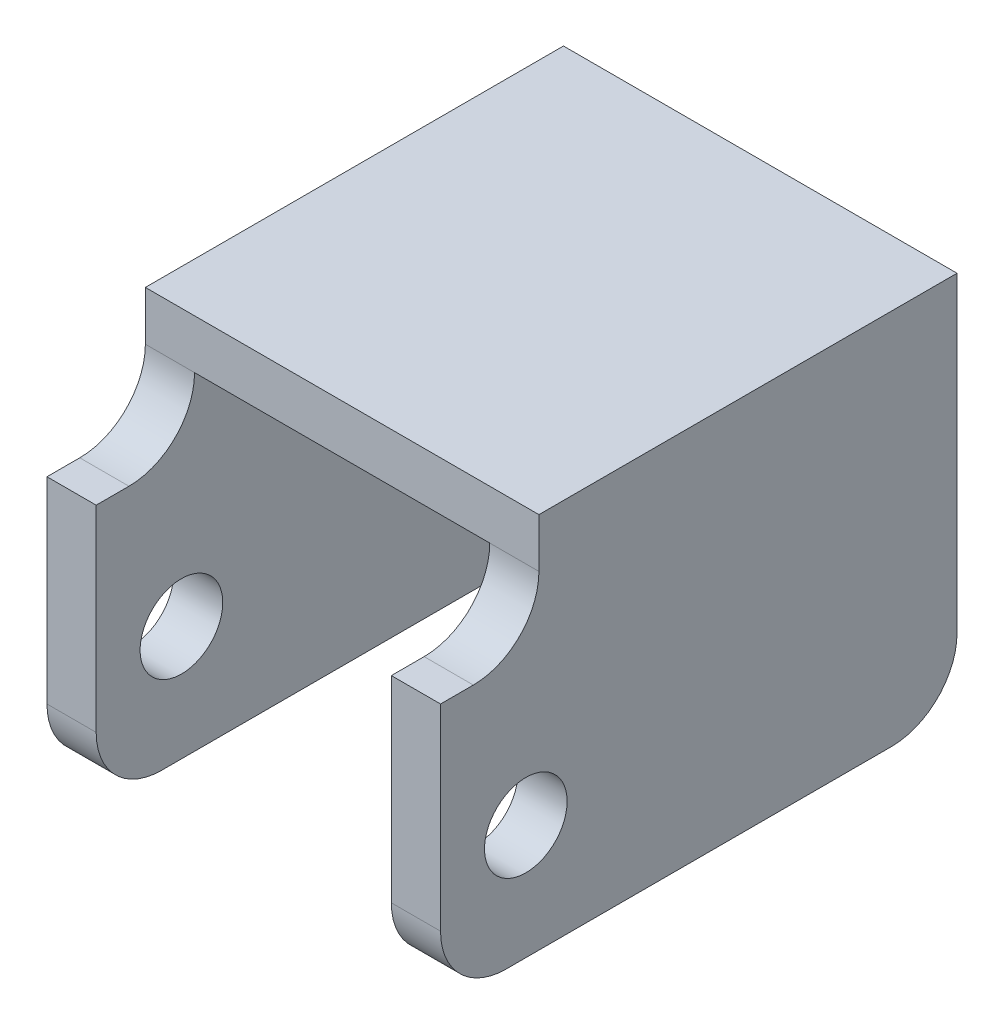
ISO-10303-21;
HEADER;
FILE_DESCRIPTION(('STEP AP214'),'2;1');
FILE_NAME('part.step','',(''),(''),'','','');
FILE_SCHEMA(('AUTOMOTIVE_DESIGN { 1 0 10303 214 1 1 1 1 }'));
ENDSEC;
DATA;
#1=APPLICATION_CONTEXT('core data for automotive mechanical design processes');
#2=APPLICATION_PROTOCOL_DEFINITION('international standard','automotive_design',2000,#1);
#3=PRODUCT_CONTEXT('',#1,'mechanical');
#4=PRODUCT('Part','Part','',(#3));
#5=PRODUCT_RELATED_PRODUCT_CATEGORY('part','',(#4));
#6=PRODUCT_DEFINITION_FORMATION('','',#4);
#7=PRODUCT_DEFINITION_CONTEXT('part definition',#1,'design');
#8=PRODUCT_DEFINITION('design','',#6,#7);
#9=PRODUCT_DEFINITION_SHAPE('','',#8);
#10=(LENGTH_UNIT() NAMED_UNIT(*) SI_UNIT(.MILLI.,.METRE.));
#11=(NAMED_UNIT(*) PLANE_ANGLE_UNIT() SI_UNIT($,.RADIAN.));
#12=(NAMED_UNIT(*) SI_UNIT($,.STERADIAN.) SOLID_ANGLE_UNIT());
#13=UNCERTAINTY_MEASURE_WITH_UNIT(LENGTH_MEASURE(1.E-05),#10,'distance_accuracy_value','');
#14=(GEOMETRIC_REPRESENTATION_CONTEXT(3) GLOBAL_UNCERTAINTY_ASSIGNED_CONTEXT((#13)) GLOBAL_UNIT_ASSIGNED_CONTEXT((#10,
#11,#12)) REPRESENTATION_CONTEXT('',''));
#15=CARTESIAN_POINT('',(0.,0.,0.));
#16=DIRECTION('',(0.,0.,1.));
#17=DIRECTION('',(1.,0.,0.));
#18=AXIS2_PLACEMENT_3D('',#15,#16,#17);
#19=CARTESIAN_POINT('',(-19.05,4.7625,0.));
#20=DIRECTION('',(1.,0.,0.));
#21=DIRECTION('',(0.,0.,-1.));
#22=AXIS2_PLACEMENT_3D('',#19,#20,#21);
#23=PLANE('',#22);
#24=CARTESIAN_POINT('',(-19.05,-20.6375,16.745));
#25=DIRECTION('',(1.,0.,0.));
#26=DIRECTION('',(0.,0.,-1.));
#27=AXIS2_PLACEMENT_3D('',#24,#25,#26);
#28=CIRCLE('',#27,4.);
#29=CARTESIAN_POINT('',(-19.05,-20.6375,12.745));
#30=VERTEX_POINT('',#29);
#31=EDGE_CURVE('E328',#30,#30,#28,.T.);
#32=ORIENTED_EDGE('',*,*,#31,.T.);
#33=EDGE_LOOP('',(#32));
#34=FACE_BOUND('',#33,.T.);
#35=DIRECTION('',(0.,-1.,0.));
#36=VECTOR('',#35,1.);
#37=CARTESIAN_POINT('',(-19.05,4.7625,-25.));
#38=LINE('',#37,#36);
#39=CARTESIAN_POINT('',(-19.05,4.7625,-25.));
#40=VERTEX_POINT('',#39);
#41=CARTESIAN_POINT('',(-19.05,-25.4,-25.));
#42=VERTEX_POINT('',#41);
#43=EDGE_CURVE('E206',#40,#42,#38,.T.);
#44=ORIENTED_EDGE('',*,*,#43,.T.);
#45=CARTESIAN_POINT('',(-19.05,-25.4,-18.65));
#46=DIRECTION('',(1.,0.,0.));
#47=DIRECTION('',(0.,0.,-1.));
#48=AXIS2_PLACEMENT_3D('',#45,#46,#47);
#49=CIRCLE('',#48,6.35);
#50=CARTESIAN_POINT('',(-19.05,-31.75,-18.65));
#51=VERTEX_POINT('',#50);
#52=EDGE_CURVE('E222',#42,#51,#49,.F.);
#53=ORIENTED_EDGE('',*,*,#52,.T.);
#54=DIRECTION('',(0.,0.,1.));
#55=VECTOR('',#54,1.);
#56=CARTESIAN_POINT('',(-19.05,-31.75,0.));
#57=LINE('',#56,#55);
#58=CARTESIAN_POINT('',(-19.05,-31.75,18.65));
#59=VERTEX_POINT('',#58);
#60=EDGE_CURVE('E301',#51,#59,#57,.T.);
#61=ORIENTED_EDGE('',*,*,#60,.T.);
#62=CARTESIAN_POINT('',(-19.05,-25.4,18.65));
#63=DIRECTION('',(1.,0.,0.));
#64=DIRECTION('',(0.,0.,-1.));
#65=AXIS2_PLACEMENT_3D('',#62,#63,#64);
#66=CIRCLE('',#65,6.35);
#67=CARTESIAN_POINT('',(-19.05,-25.4,25.));
#68=VERTEX_POINT('',#67);
#69=EDGE_CURVE('E220',#59,#68,#66,.F.);
#70=ORIENTED_EDGE('',*,*,#69,.T.);
#71=DIRECTION('',(0.,-1.,0.));
#72=VECTOR('',#71,1.);
#73=CARTESIAN_POINT('',(-19.05,4.7625,25.));
#74=LINE('',#73,#72);
#75=CARTESIAN_POINT('',(-19.05,-6.35,25.));
#76=VERTEX_POINT('',#75);
#77=EDGE_CURVE('E203',#76,#68,#74,.T.);
#78=ORIENTED_EDGE('',*,*,#77,.F.);
#79=DIRECTION('',(0.,0.,1.));
#80=VECTOR('',#79,1.);
#81=CARTESIAN_POINT('',(-19.05,-6.35,0.));
#82=LINE('',#81,#80);
#83=CARTESIAN_POINT('',(-19.05,-6.35,21.825));
#84=VERTEX_POINT('',#83);
#85=EDGE_CURVE('E171',#84,#76,#82,.T.);
#86=ORIENTED_EDGE('',*,*,#85,.F.);
#87=CARTESIAN_POINT('',(-19.05,0.,21.825));
#88=DIRECTION('',(1.,0.,0.));
#89=DIRECTION('',(0.,0.,-1.));
#90=AXIS2_PLACEMENT_3D('',#87,#88,#89);
#91=CIRCLE('',#90,6.35);
#92=CARTESIAN_POINT('',(-19.05,0.,15.475));
#93=VERTEX_POINT('',#92);
#94=EDGE_CURVE('E166',#84,#93,#91,.T.);
#95=ORIENTED_EDGE('',*,*,#94,.T.);
#96=DIRECTION('',(0.,1.,0.));
#97=VECTOR('',#96,1.);
#98=CARTESIAN_POINT('',(-19.05,0.,15.475));
#99=LINE('',#98,#97);
#100=CARTESIAN_POINT('',(-19.05,4.7625,15.475));
#101=VERTEX_POINT('',#100);
#102=EDGE_CURVE('E158',#93,#101,#99,.T.);
#103=ORIENTED_EDGE('',*,*,#102,.T.);
#104=DIRECTION('',(0.,0.,1.));
#105=VECTOR('',#104,1.);
#106=CARTESIAN_POINT('',(-19.05,4.7625,0.));
#107=LINE('',#106,#105);
#108=EDGE_CURVE('E162',#40,#101,#107,.T.);
#109=ORIENTED_EDGE('',*,*,#108,.F.);
#110=EDGE_LOOP('',(#44,#53,#61,#70,#78,#86,#95,#103,#109));
#111=FACE_BOUND('',#110,.T.);
#112=ADVANCED_FACE('F38',(#34,#111),#23,.F.);
#113=CARTESIAN_POINT('',(0.,4.7625,25.));
#114=DIRECTION('',(0.,0.,1.));
#115=DIRECTION('',(1.,0.,0.));
#116=AXIS2_PLACEMENT_3D('',#113,#114,#115);
#117=PLANE('',#116);
#118=DIRECTION('',(0.,1.,0.));
#119=VECTOR('',#118,1.);
#120=CARTESIAN_POINT('',(14.2875,-31.75,25.));
#121=LINE('',#120,#119);
#122=CARTESIAN_POINT('',(14.2875,-25.4,25.));
#123=VERTEX_POINT('',#122);
#124=CARTESIAN_POINT('',(14.2875,-6.35,25.));
#125=VERTEX_POINT('',#124);
#126=EDGE_CURVE('E296',#123,#125,#121,.T.);
#127=ORIENTED_EDGE('',*,*,#126,.F.);
#128=DIRECTION('',(1.,0.,0.));
#129=VECTOR('',#128,1.);
#130=CARTESIAN_POINT('',(19.05,-25.4,25.));
#131=LINE('',#130,#129);
#132=CARTESIAN_POINT('',(19.05,-25.4,25.));
#133=VERTEX_POINT('',#132);
#134=EDGE_CURVE('E247',#123,#133,#131,.T.);
#135=ORIENTED_EDGE('',*,*,#134,.T.);
#136=DIRECTION('',(0.,-1.,0.));
#137=VECTOR('',#136,1.);
#138=CARTESIAN_POINT('',(19.05,4.7625,25.));
#139=LINE('',#138,#137);
#140=CARTESIAN_POINT('',(19.05,-6.35,25.));
#141=VERTEX_POINT('',#140);
#142=EDGE_CURVE('E200',#141,#133,#139,.T.);
#143=ORIENTED_EDGE('',*,*,#142,.F.);
#144=DIRECTION('',(1.,0.,0.));
#145=VECTOR('',#144,1.);
#146=CARTESIAN_POINT('',(-19.05,-6.35,25.));
#147=LINE('',#146,#145);
#148=EDGE_CURVE('E181',#125,#141,#147,.T.);
#149=ORIENTED_EDGE('',*,*,#148,.F.);
#150=EDGE_LOOP('',(#127,#135,#143,#149));
#151=FACE_BOUND('',#150,.T.);
#152=ADVANCED_FACE('F350',(#151),#117,.T.);
#153=ORIENTED_EDGE('',*,*,#77,.T.);
#154=DIRECTION('',(-1.,0.,0.));
#155=VECTOR('',#154,1.);
#156=CARTESIAN_POINT('',(-14.2875,-25.4,25.));
#157=LINE('',#156,#155);
#158=CARTESIAN_POINT('',(-14.2875,-25.4,25.));
#159=VERTEX_POINT('',#158);
#160=EDGE_CURVE('E245',#68,#159,#157,.F.);
#161=ORIENTED_EDGE('',*,*,#160,.T.);
#162=DIRECTION('',(0.,1.,0.));
#163=VECTOR('',#162,1.);
#164=CARTESIAN_POINT('',(-14.2875,-31.75,25.));
#165=LINE('',#164,#163);
#166=CARTESIAN_POINT('',(-14.2875,-6.35,25.));
#167=VERTEX_POINT('',#166);
#168=EDGE_CURVE('E307',#159,#167,#165,.T.);
#169=ORIENTED_EDGE('',*,*,#168,.T.);
#170=EDGE_CURVE('E213',#76,#167,#147,.T.);
#171=ORIENTED_EDGE('',*,*,#170,.F.);
#172=EDGE_LOOP('',(#153,#161,#169,#171));
#173=FACE_BOUND('',#172,.T.);
#174=ADVANCED_FACE('F312',(#173),#117,.T.);
#175=CARTESIAN_POINT('',(19.05,4.7625,0.));
#176=DIRECTION('',(1.,0.,0.));
#177=DIRECTION('',(0.,0.,-1.));
#178=AXIS2_PLACEMENT_3D('',#175,#176,#177);
#179=PLANE('',#178);
#180=CARTESIAN_POINT('',(19.05,-20.6375,16.745));
#181=DIRECTION('',(1.,0.,0.));
#182=DIRECTION('',(0.,0.,-1.));
#183=AXIS2_PLACEMENT_3D('',#180,#181,#182);
#184=CIRCLE('',#183,4.);
#185=CARTESIAN_POINT('',(19.05,-20.6375,12.745));
#186=VERTEX_POINT('',#185);
#187=EDGE_CURVE('E269',#186,#186,#184,.T.);
#188=ORIENTED_EDGE('',*,*,#187,.F.);
#189=EDGE_LOOP('',(#188));
#190=FACE_BOUND('',#189,.T.);
#191=DIRECTION('',(0.,0.,1.));
#192=VECTOR('',#191,1.);
#193=CARTESIAN_POINT('',(19.05,-31.75,0.));
#194=LINE('',#193,#192);
#195=CARTESIAN_POINT('',(19.05,-31.75,-18.65));
#196=VERTEX_POINT('',#195);
#197=CARTESIAN_POINT('',(19.05,-31.75,18.65));
#198=VERTEX_POINT('',#197);
#199=EDGE_CURVE('E287',#196,#198,#194,.T.);
#200=ORIENTED_EDGE('',*,*,#199,.F.);
#201=CARTESIAN_POINT('',(19.05,-25.4,-18.65));
#202=DIRECTION('',(1.,0.,0.));
#203=DIRECTION('',(0.,0.,-1.));
#204=AXIS2_PLACEMENT_3D('',#201,#202,#203);
#205=CIRCLE('',#204,6.35);
#206=CARTESIAN_POINT('',(19.05,-25.4,-25.));
#207=VERTEX_POINT('',#206);
#208=EDGE_CURVE('E240',#196,#207,#205,.T.);
#209=ORIENTED_EDGE('',*,*,#208,.T.);
#210=DIRECTION('',(0.,-1.,0.));
#211=VECTOR('',#210,1.);
#212=CARTESIAN_POINT('',(19.05,4.7625,-25.));
#213=LINE('',#212,#211);
#214=CARTESIAN_POINT('',(19.05,4.7625,-25.));
#215=VERTEX_POINT('',#214);
#216=EDGE_CURVE('E189',#215,#207,#213,.T.);
#217=ORIENTED_EDGE('',*,*,#216,.F.);
#218=DIRECTION('',(0.,0.,1.));
#219=VECTOR('',#218,1.);
#220=CARTESIAN_POINT('',(19.05,4.7625,0.));
#221=LINE('',#220,#219);
#222=CARTESIAN_POINT('',(19.05,4.7625,15.475));
#223=VERTEX_POINT('',#222);
#224=EDGE_CURVE('E187',#215,#223,#221,.T.);
#225=ORIENTED_EDGE('',*,*,#224,.T.);
#226=DIRECTION('',(0.,1.,0.));
#227=VECTOR('',#226,1.);
#228=CARTESIAN_POINT('',(19.05,0.,15.475));
#229=LINE('',#228,#227);
#230=CARTESIAN_POINT('',(19.05,0.,15.475));
#231=VERTEX_POINT('',#230);
#232=EDGE_CURVE('E177',#231,#223,#229,.T.);
#233=ORIENTED_EDGE('',*,*,#232,.F.);
#234=CARTESIAN_POINT('',(19.05,0.,21.825));
#235=DIRECTION('',(1.,0.,0.));
#236=DIRECTION('',(0.,0.,-1.));
#237=AXIS2_PLACEMENT_3D('',#234,#235,#236);
#238=CIRCLE('',#237,6.35);
#239=CARTESIAN_POINT('',(19.05,-6.35,21.825));
#240=VERTEX_POINT('',#239);
#241=EDGE_CURVE('E46',#231,#240,#238,.F.);
#242=ORIENTED_EDGE('',*,*,#241,.T.);
#243=DIRECTION('',(0.,0.,1.));
#244=VECTOR('',#243,1.);
#245=CARTESIAN_POINT('',(19.05,-6.35,0.));
#246=LINE('',#245,#244);
#247=EDGE_CURVE('E262',#240,#141,#246,.T.);
#248=ORIENTED_EDGE('',*,*,#247,.T.);
#249=ORIENTED_EDGE('',*,*,#142,.T.);
#250=CARTESIAN_POINT('',(19.05,-25.4,18.65));
#251=DIRECTION('',(1.,0.,0.));
#252=DIRECTION('',(0.,0.,-1.));
#253=AXIS2_PLACEMENT_3D('',#250,#251,#252);
#254=CIRCLE('',#253,6.35);
#255=EDGE_CURVE('E238',#133,#198,#254,.T.);
#256=ORIENTED_EDGE('',*,*,#255,.T.);
#257=EDGE_LOOP('',(#200,#209,#217,#225,#233,#242,#248,#249,#256));
#258=FACE_BOUND('',#257,.T.);
#259=ADVANCED_FACE('F261',(#190,#258),#179,.T.);
#260=CARTESIAN_POINT('',(-14.2875,-31.75,0.));
#261=DIRECTION('',(1.,0.,0.));
#262=DIRECTION('',(0.,0.,-1.));
#263=AXIS2_PLACEMENT_3D('',#260,#261,#262);
#264=PLANE('',#263);
#265=CARTESIAN_POINT('',(-14.2875,-20.6375,16.745));
#266=DIRECTION('',(1.,0.,0.));
#267=DIRECTION('',(0.,0.,-1.));
#268=AXIS2_PLACEMENT_3D('',#265,#266,#267);
#269=CIRCLE('',#268,4.);
#270=CARTESIAN_POINT('',(-14.2875,-20.6375,12.745));
#271=VERTEX_POINT('',#270);
#272=EDGE_CURVE('E212',#271,#271,#269,.T.);
#273=ORIENTED_EDGE('',*,*,#272,.F.);
#274=EDGE_LOOP('',(#273));
#275=FACE_BOUND('',#274,.T.);
#276=DIRECTION('',(0.,0.,-1.));
#277=VECTOR('',#276,1.);
#278=CARTESIAN_POINT('',(-14.2875,-31.75,0.));
#279=LINE('',#278,#277);
#280=CARTESIAN_POINT('',(-14.2875,-31.75,18.65));
#281=VERTEX_POINT('',#280);
#282=CARTESIAN_POINT('',(-14.2875,-31.75,-18.65));
#283=VERTEX_POINT('',#282);
#284=EDGE_CURVE('E304',#281,#283,#279,.T.);
#285=ORIENTED_EDGE('',*,*,#284,.T.);
#286=CARTESIAN_POINT('',(-14.2875,-25.4,-18.65));
#287=DIRECTION('',(1.,0.,0.));
#288=DIRECTION('',(0.,0.,-1.));
#289=AXIS2_PLACEMENT_3D('',#286,#287,#288);
#290=CIRCLE('',#289,6.35);
#291=CARTESIAN_POINT('',(-14.2875,-25.4,-25.));
#292=VERTEX_POINT('',#291);
#293=EDGE_CURVE('E231',#283,#292,#290,.T.);
#294=ORIENTED_EDGE('',*,*,#293,.T.);
#295=DIRECTION('',(0.,1.,0.));
#296=VECTOR('',#295,1.);
#297=CARTESIAN_POINT('',(-14.2875,-31.75,-25.));
#298=LINE('',#297,#296);
#299=CARTESIAN_POINT('',(-14.2875,0.,-25.));
#300=VERTEX_POINT('',#299);
#301=EDGE_CURVE('E197',#292,#300,#298,.T.);
#302=ORIENTED_EDGE('',*,*,#301,.T.);
#303=DIRECTION('',(0.,0.,-1.));
#304=VECTOR('',#303,1.);
#305=CARTESIAN_POINT('',(-14.2875,0.,0.));
#306=LINE('',#305,#304);
#307=CARTESIAN_POINT('',(-14.2875,0.,15.475));
#308=VERTEX_POINT('',#307);
#309=EDGE_CURVE('E298',#308,#300,#306,.T.);
#310=ORIENTED_EDGE('',*,*,#309,.F.);
#311=CARTESIAN_POINT('',(-14.2875,0.,21.825));
#312=DIRECTION('',(1.,0.,0.));
#313=DIRECTION('',(0.,0.,-1.));
#314=AXIS2_PLACEMENT_3D('',#311,#312,#313);
#315=CIRCLE('',#314,6.35);
#316=CARTESIAN_POINT('',(-14.2875,-6.35,21.825));
#317=VERTEX_POINT('',#316);
#318=EDGE_CURVE('E257',#308,#317,#315,.F.);
#319=ORIENTED_EDGE('',*,*,#318,.T.);
#320=DIRECTION('',(0.,0.,1.));
#321=VECTOR('',#320,1.);
#322=CARTESIAN_POINT('',(-14.2875,-6.35,0.));
#323=LINE('',#322,#321);
#324=EDGE_CURVE('E284',#317,#167,#323,.T.);
#325=ORIENTED_EDGE('',*,*,#324,.T.);
#326=ORIENTED_EDGE('',*,*,#168,.F.);
#327=CARTESIAN_POINT('',(-14.2875,-25.4,18.65));
#328=DIRECTION('',(1.,0.,0.));
#329=DIRECTION('',(0.,0.,-1.));
#330=AXIS2_PLACEMENT_3D('',#327,#328,#329);
#331=CIRCLE('',#330,6.35);
#332=EDGE_CURVE('E229',#159,#281,#331,.T.);
#333=ORIENTED_EDGE('',*,*,#332,.T.);
#334=EDGE_LOOP('',(#285,#294,#302,#310,#319,#325,#326,#333));
#335=FACE_BOUND('',#334,.T.);
#336=ADVANCED_FACE('F319',(#275,#335),#264,.T.);
#337=CARTESIAN_POINT('',(14.2875,-31.75,0.));
#338=DIRECTION('',(1.,0.,0.));
#339=DIRECTION('',(0.,0.,-1.));
#340=AXIS2_PLACEMENT_3D('',#337,#338,#339);
#341=PLANE('',#340);
#342=CARTESIAN_POINT('',(14.2875,-20.6375,16.745));
#343=DIRECTION('',(1.,0.,0.));
#344=DIRECTION('',(0.,0.,-1.));
#345=AXIS2_PLACEMENT_3D('',#342,#343,#344);
#346=CIRCLE('',#345,4.);
#347=CARTESIAN_POINT('',(14.2875,-20.6375,12.745));
#348=VERTEX_POINT('',#347);
#349=EDGE_CURVE('E209',#348,#348,#346,.T.);
#350=ORIENTED_EDGE('',*,*,#349,.T.);
#351=EDGE_LOOP('',(#350));
#352=FACE_BOUND('',#351,.T.);
#353=DIRECTION('',(0.,1.,0.));
#354=VECTOR('',#353,1.);
#355=CARTESIAN_POINT('',(14.2875,-31.75,-25.));
#356=LINE('',#355,#354);
#357=CARTESIAN_POINT('',(14.2875,-25.4,-25.));
#358=VERTEX_POINT('',#357);
#359=CARTESIAN_POINT('',(14.2875,0.,-25.));
#360=VERTEX_POINT('',#359);
#361=EDGE_CURVE('E299',#358,#360,#356,.T.);
#362=ORIENTED_EDGE('',*,*,#361,.F.);
#363=CARTESIAN_POINT('',(14.2875,-25.4,-18.65));
#364=DIRECTION('',(1.,0.,0.));
#365=DIRECTION('',(0.,0.,-1.));
#366=AXIS2_PLACEMENT_3D('',#363,#364,#365);
#367=CIRCLE('',#366,6.35);
#368=CARTESIAN_POINT('',(14.2875,-31.75,-18.65));
#369=VERTEX_POINT('',#368);
#370=EDGE_CURVE('E243',#358,#369,#367,.F.);
#371=ORIENTED_EDGE('',*,*,#370,.T.);
#372=DIRECTION('',(0.,0.,-1.));
#373=VECTOR('',#372,1.);
#374=CARTESIAN_POINT('',(14.2875,-31.75,0.));
#375=LINE('',#374,#373);
#376=CARTESIAN_POINT('',(14.2875,-31.75,18.65));
#377=VERTEX_POINT('',#376);
#378=EDGE_CURVE('E290',#377,#369,#375,.T.);
#379=ORIENTED_EDGE('',*,*,#378,.F.);
#380=CARTESIAN_POINT('',(14.2875,-25.4,18.65));
#381=DIRECTION('',(1.,0.,0.));
#382=DIRECTION('',(0.,0.,-1.));
#383=AXIS2_PLACEMENT_3D('',#380,#381,#382);
#384=CIRCLE('',#383,6.35);
#385=EDGE_CURVE('E53',#377,#123,#384,.F.);
#386=ORIENTED_EDGE('',*,*,#385,.T.);
#387=ORIENTED_EDGE('',*,*,#126,.T.);
#388=DIRECTION('',(0.,0.,1.));
#389=VECTOR('',#388,1.);
#390=CARTESIAN_POINT('',(14.2875,-6.35,0.));
#391=LINE('',#390,#389);
#392=CARTESIAN_POINT('',(14.2875,-6.35,21.825));
#393=VERTEX_POINT('',#392);
#394=EDGE_CURVE('E208',#393,#125,#391,.T.);
#395=ORIENTED_EDGE('',*,*,#394,.F.);
#396=CARTESIAN_POINT('',(14.2875,0.,21.825));
#397=DIRECTION('',(1.,0.,0.));
#398=DIRECTION('',(0.,0.,-1.));
#399=AXIS2_PLACEMENT_3D('',#396,#397,#398);
#400=CIRCLE('',#399,6.35);
#401=CARTESIAN_POINT('',(14.2875,0.,15.475));
#402=VERTEX_POINT('',#401);
#403=EDGE_CURVE('E11',#393,#402,#400,.T.);
#404=ORIENTED_EDGE('',*,*,#403,.T.);
#405=DIRECTION('',(0.,0.,-1.));
#406=VECTOR('',#405,1.);
#407=CARTESIAN_POINT('',(14.2875,0.,0.));
#408=LINE('',#407,#406);
#409=EDGE_CURVE('E277',#402,#360,#408,.T.);
#410=ORIENTED_EDGE('',*,*,#409,.T.);
#411=EDGE_LOOP('',(#362,#371,#379,#386,#387,#395,#404,#410));
#412=FACE_BOUND('',#411,.T.);
#413=ADVANCED_FACE('F275',(#352,#412),#341,.F.);
#414=CARTESIAN_POINT('',(0.,0.,0.));
#415=DIRECTION('',(0.,1.,0.));
#416=DIRECTION('',(0.,0.,1.));
#417=AXIS2_PLACEMENT_3D('',#414,#415,#416);
#418=PLANE('',#417);
#419=ORIENTED_EDGE('',*,*,#409,.F.);
#420=DIRECTION('',(-1.,0.,0.));
#421=VECTOR('',#420,1.);
#422=CARTESIAN_POINT('',(0.,0.,15.475));
#423=LINE('',#422,#421);
#424=EDGE_CURVE('E280',#402,#308,#423,.T.);
#425=ORIENTED_EDGE('',*,*,#424,.T.);
#426=ORIENTED_EDGE('',*,*,#309,.T.);
#427=DIRECTION('',(-1.,0.,0.));
#428=VECTOR('',#427,1.);
#429=CARTESIAN_POINT('',(0.,0.,-25.));
#430=LINE('',#429,#428);
#431=EDGE_CURVE('E191',#360,#300,#430,.T.);
#432=ORIENTED_EDGE('',*,*,#431,.F.);
#433=EDGE_LOOP('',(#419,#425,#426,#432));
#434=FACE_BOUND('',#433,.T.);
#435=ADVANCED_FACE('F286',(#434),#418,.F.);
#436=CARTESIAN_POINT('',(0.,4.7625,-25.));
#437=DIRECTION('',(0.,0.,1.));
#438=DIRECTION('',(1.,0.,0.));
#439=AXIS2_PLACEMENT_3D('',#436,#437,#438);
#440=PLANE('',#439);
#441=ORIENTED_EDGE('',*,*,#301,.F.);
#442=DIRECTION('',(-1.,0.,0.));
#443=VECTOR('',#442,1.);
#444=CARTESIAN_POINT('',(0.,-25.4,-25.));
#445=LINE('',#444,#443);
#446=EDGE_CURVE('E217',#292,#42,#445,.T.);
#447=ORIENTED_EDGE('',*,*,#446,.T.);
#448=ORIENTED_EDGE('',*,*,#43,.F.);
#449=DIRECTION('',(-1.,0.,0.));
#450=VECTOR('',#449,1.);
#451=CARTESIAN_POINT('',(0.,4.7625,-25.));
#452=LINE('',#451,#450);
#453=EDGE_CURVE('E185',#215,#40,#452,.T.);
#454=ORIENTED_EDGE('',*,*,#453,.F.);
#455=ORIENTED_EDGE('',*,*,#216,.T.);
#456=DIRECTION('',(1.,0.,0.));
#457=VECTOR('',#456,1.);
#458=CARTESIAN_POINT('',(0.,-25.4,-25.));
#459=LINE('',#458,#457);
#460=EDGE_CURVE('E215',#207,#358,#459,.F.);
#461=ORIENTED_EDGE('',*,*,#460,.T.);
#462=ORIENTED_EDGE('',*,*,#361,.T.);
#463=ORIENTED_EDGE('',*,*,#431,.T.);
#464=EDGE_LOOP('',(#441,#447,#448,#454,#455,#461,#462,#463));
#465=FACE_BOUND('',#464,.T.);
#466=ADVANCED_FACE('F359',(#465),#440,.F.);
#467=CARTESIAN_POINT('',(0.,4.7625,0.));
#468=DIRECTION('',(0.,1.,0.));
#469=DIRECTION('',(0.,0.,1.));
#470=AXIS2_PLACEMENT_3D('',#467,#468,#469);
#471=PLANE('',#470);
#472=DIRECTION('',(1.,0.,0.));
#473=VECTOR('',#472,1.);
#474=CARTESIAN_POINT('',(-19.05,4.7625,15.475));
#475=LINE('',#474,#473);
#476=EDGE_CURVE('E170',#101,#223,#475,.T.);
#477=ORIENTED_EDGE('',*,*,#476,.T.);
#478=ORIENTED_EDGE('',*,*,#224,.F.);
#479=ORIENTED_EDGE('',*,*,#453,.T.);
#480=ORIENTED_EDGE('',*,*,#108,.T.);
#481=EDGE_LOOP('',(#477,#478,#479,#480));
#482=FACE_BOUND('',#481,.T.);
#483=ADVANCED_FACE('F183',(#482),#471,.T.);
#484=CARTESIAN_POINT('',(0.,-31.75,0.));
#485=DIRECTION('',(0.,1.,0.));
#486=DIRECTION('',(0.,0.,1.));
#487=AXIS2_PLACEMENT_3D('',#484,#485,#486);
#488=PLANE('',#487);
#489=ORIENTED_EDGE('',*,*,#60,.F.);
#490=DIRECTION('',(-1.,0.,0.));
#491=VECTOR('',#490,1.);
#492=CARTESIAN_POINT('',(0.,-31.75,-18.65));
#493=LINE('',#492,#491);
#494=EDGE_CURVE('E227',#51,#283,#493,.F.);
#495=ORIENTED_EDGE('',*,*,#494,.T.);
#496=ORIENTED_EDGE('',*,*,#284,.F.);
#497=DIRECTION('',(-1.,0.,0.));
#498=VECTOR('',#497,1.);
#499=CARTESIAN_POINT('',(-19.05,-31.75,18.65));
#500=LINE('',#499,#498);
#501=EDGE_CURVE('E224',#281,#59,#500,.T.);
#502=ORIENTED_EDGE('',*,*,#501,.T.);
#503=EDGE_LOOP('',(#489,#495,#496,#502));
#504=FACE_BOUND('',#503,.T.);
#505=ADVANCED_FACE('F390',(#504),#488,.F.);
#506=CARTESIAN_POINT('',(0.,-31.75,0.));
#507=DIRECTION('',(0.,1.,0.));
#508=DIRECTION('',(0.,0.,1.));
#509=AXIS2_PLACEMENT_3D('',#506,#507,#508);
#510=PLANE('',#509);
#511=ORIENTED_EDGE('',*,*,#378,.T.);
#512=DIRECTION('',(1.,0.,0.));
#513=VECTOR('',#512,1.);
#514=CARTESIAN_POINT('',(0.,-31.75,-18.65));
#515=LINE('',#514,#513);
#516=EDGE_CURVE('E235',#369,#196,#515,.T.);
#517=ORIENTED_EDGE('',*,*,#516,.T.);
#518=ORIENTED_EDGE('',*,*,#199,.T.);
#519=DIRECTION('',(1.,0.,0.));
#520=VECTOR('',#519,1.);
#521=CARTESIAN_POINT('',(14.2875,-31.75,18.65));
#522=LINE('',#521,#520);
#523=EDGE_CURVE('E233',#198,#377,#522,.F.);
#524=ORIENTED_EDGE('',*,*,#523,.T.);
#525=EDGE_LOOP('',(#511,#517,#518,#524));
#526=FACE_BOUND('',#525,.T.);
#527=ADVANCED_FACE('F399',(#526),#510,.F.);
#528=CARTESIAN_POINT('',(-19.05,-20.6375,16.745));
#529=DIRECTION('',(1.,0.,0.));
#530=DIRECTION('',(0.,0.,-1.));
#531=AXIS2_PLACEMENT_3D('',#528,#529,#530);
#532=CYLINDRICAL_SURFACE('',#531,4.);
#533=ORIENTED_EDGE('',*,*,#187,.T.);
#534=EDGE_LOOP('',(#533));
#535=FACE_BOUND('',#534,.T.);
#536=ORIENTED_EDGE('',*,*,#349,.F.);
#537=EDGE_LOOP('',(#536));
#538=FACE_BOUND('',#537,.T.);
#539=ADVANCED_FACE('F403',(#535,#538),#532,.F.);
#540=CARTESIAN_POINT('',(-19.05,-6.35,0.));
#541=DIRECTION('',(0.,1.,0.));
#542=DIRECTION('',(0.,0.,1.));
#543=AXIS2_PLACEMENT_3D('',#540,#541,#542);
#544=PLANE('',#543);
#545=ORIENTED_EDGE('',*,*,#247,.F.);
#546=DIRECTION('',(1.,0.,0.));
#547=VECTOR('',#546,1.);
#548=CARTESIAN_POINT('',(-19.05,-6.35,21.825));
#549=LINE('',#548,#547);
#550=EDGE_CURVE('E61',#240,#393,#549,.F.);
#551=ORIENTED_EDGE('',*,*,#550,.T.);
#552=ORIENTED_EDGE('',*,*,#394,.T.);
#553=ORIENTED_EDGE('',*,*,#148,.T.);
#554=EDGE_LOOP('',(#545,#551,#552,#553));
#555=FACE_BOUND('',#554,.T.);
#556=ADVANCED_FACE('F266',(#555),#544,.T.);
#557=ORIENTED_EDGE('',*,*,#324,.F.);
#558=DIRECTION('',(1.,0.,0.));
#559=VECTOR('',#558,1.);
#560=CARTESIAN_POINT('',(-19.05,-6.35,21.825));
#561=LINE('',#560,#559);
#562=EDGE_CURVE('E254',#317,#84,#561,.F.);
#563=ORIENTED_EDGE('',*,*,#562,.T.);
#564=ORIENTED_EDGE('',*,*,#85,.T.);
#565=ORIENTED_EDGE('',*,*,#170,.T.);
#566=EDGE_LOOP('',(#557,#563,#564,#565));
#567=FACE_BOUND('',#566,.T.);
#568=ADVANCED_FACE('F322',(#567),#544,.T.);
#569=CARTESIAN_POINT('',(-19.05,0.,15.475));
#570=DIRECTION('',(0.,0.,-1.));
#571=DIRECTION('',(0.,1.,0.));
#572=AXIS2_PLACEMENT_3D('',#569,#570,#571);
#573=PLANE('',#572);
#574=ORIENTED_EDGE('',*,*,#102,.F.);
#575=DIRECTION('',(1.,0.,0.));
#576=VECTOR('',#575,1.);
#577=CARTESIAN_POINT('',(-19.05,0.,15.475));
#578=LINE('',#577,#576);
#579=EDGE_CURVE('E252',#93,#308,#578,.T.);
#580=ORIENTED_EDGE('',*,*,#579,.T.);
#581=ORIENTED_EDGE('',*,*,#424,.F.);
#582=DIRECTION('',(1.,0.,0.));
#583=VECTOR('',#582,1.);
#584=CARTESIAN_POINT('',(-19.05,0.,15.475));
#585=LINE('',#584,#583);
#586=EDGE_CURVE('E250',#402,#231,#585,.T.);
#587=ORIENTED_EDGE('',*,*,#586,.T.);
#588=ORIENTED_EDGE('',*,*,#232,.T.);
#589=ORIENTED_EDGE('',*,*,#476,.F.);
#590=EDGE_LOOP('',(#574,#580,#581,#587,#588,#589));
#591=FACE_BOUND('',#590,.T.);
#592=ADVANCED_FACE('F174',(#591),#573,.F.);
#593=ORIENTED_EDGE('',*,*,#272,.T.);
#594=EDGE_LOOP('',(#593));
#595=FACE_BOUND('',#594,.T.);
#596=ORIENTED_EDGE('',*,*,#31,.F.);
#597=EDGE_LOOP('',(#596));
#598=FACE_BOUND('',#597,.T.);
#599=ADVANCED_FACE('F334',(#595,#598),#532,.F.);
#600=CARTESIAN_POINT('',(0.,-25.4,-18.65));
#601=DIRECTION('',(-1.,0.,0.));
#602=DIRECTION('',(0.,0.,1.));
#603=AXIS2_PLACEMENT_3D('',#600,#601,#602);
#604=CYLINDRICAL_SURFACE('',#603,6.35);
#605=ORIENTED_EDGE('',*,*,#293,.F.);
#606=ORIENTED_EDGE('',*,*,#494,.F.);
#607=ORIENTED_EDGE('',*,*,#52,.F.);
#608=ORIENTED_EDGE('',*,*,#446,.F.);
#609=EDGE_LOOP('',(#605,#606,#607,#608));
#610=FACE_BOUND('',#609,.T.);
#611=ADVANCED_FACE('F363',(#610),#604,.T.);
#612=CARTESIAN_POINT('',(0.,-25.4,-18.65));
#613=DIRECTION('',(1.,0.,0.));
#614=DIRECTION('',(0.,0.,-1.));
#615=AXIS2_PLACEMENT_3D('',#612,#613,#614);
#616=CYLINDRICAL_SURFACE('',#615,6.35);
#617=ORIENTED_EDGE('',*,*,#370,.F.);
#618=ORIENTED_EDGE('',*,*,#460,.F.);
#619=ORIENTED_EDGE('',*,*,#208,.F.);
#620=ORIENTED_EDGE('',*,*,#516,.F.);
#621=EDGE_LOOP('',(#617,#618,#619,#620));
#622=FACE_BOUND('',#621,.T.);
#623=ADVANCED_FACE('F366',(#622),#616,.T.);
#624=CARTESIAN_POINT('',(0.,-25.4,18.65));
#625=DIRECTION('',(1.,0.,0.));
#626=DIRECTION('',(0.,0.,-1.));
#627=AXIS2_PLACEMENT_3D('',#624,#625,#626);
#628=CYLINDRICAL_SURFACE('',#627,6.35);
#629=ORIENTED_EDGE('',*,*,#332,.F.);
#630=ORIENTED_EDGE('',*,*,#160,.F.);
#631=ORIENTED_EDGE('',*,*,#69,.F.);
#632=ORIENTED_EDGE('',*,*,#501,.F.);
#633=EDGE_LOOP('',(#629,#630,#631,#632));
#634=FACE_BOUND('',#633,.T.);
#635=ADVANCED_FACE('F370',(#634),#628,.T.);
#636=CARTESIAN_POINT('',(0.,-25.4,18.65));
#637=DIRECTION('',(-1.,0.,0.));
#638=DIRECTION('',(0.,0.,1.));
#639=AXIS2_PLACEMENT_3D('',#636,#637,#638);
#640=CYLINDRICAL_SURFACE('',#639,6.35);
#641=ORIENTED_EDGE('',*,*,#385,.F.);
#642=ORIENTED_EDGE('',*,*,#523,.F.);
#643=ORIENTED_EDGE('',*,*,#255,.F.);
#644=ORIENTED_EDGE('',*,*,#134,.F.);
#645=EDGE_LOOP('',(#641,#642,#643,#644));
#646=FACE_BOUND('',#645,.T.);
#647=ADVANCED_FACE('F374',(#646),#640,.T.);
#648=CARTESIAN_POINT('',(-19.05,0.,21.825));
#649=DIRECTION('',(1.,0.,0.));
#650=DIRECTION('',(0.,0.,-1.));
#651=AXIS2_PLACEMENT_3D('',#648,#649,#650);
#652=CYLINDRICAL_SURFACE('',#651,6.35);
#653=ORIENTED_EDGE('',*,*,#94,.F.);
#654=ORIENTED_EDGE('',*,*,#562,.F.);
#655=ORIENTED_EDGE('',*,*,#318,.F.);
#656=ORIENTED_EDGE('',*,*,#579,.F.);
#657=EDGE_LOOP('',(#653,#654,#655,#656));
#658=FACE_BOUND('',#657,.T.);
#659=ADVANCED_FACE('F377',(#658),#652,.F.);
#660=CARTESIAN_POINT('',(-19.05,0.,21.825));
#661=DIRECTION('',(1.,0.,0.));
#662=DIRECTION('',(0.,0.,-1.));
#663=AXIS2_PLACEMENT_3D('',#660,#661,#662);
#664=CYLINDRICAL_SURFACE('',#663,6.35);
#665=ORIENTED_EDGE('',*,*,#403,.F.);
#666=ORIENTED_EDGE('',*,*,#550,.F.);
#667=ORIENTED_EDGE('',*,*,#241,.F.);
#668=ORIENTED_EDGE('',*,*,#586,.F.);
#669=EDGE_LOOP('',(#665,#666,#667,#668));
#670=FACE_BOUND('',#669,.T.);
#671=ADVANCED_FACE('F40',(#670),#664,.F.);
#672=CLOSED_SHELL('',(#112,#152,#174,#259,#336,#413,#435,#466,#483,#505,#527,#539,#556,#568,
#592,#599,#611,#623,#635,#647,#659,#671));
#673=MANIFOLD_SOLID_BREP('B2',#672);
#674=ADVANCED_BREP_SHAPE_REPRESENTATION('',(#18,#673),#14);
#675=SHAPE_DEFINITION_REPRESENTATION(#9,#674);
ENDSEC;
END-ISO-10303-21;
